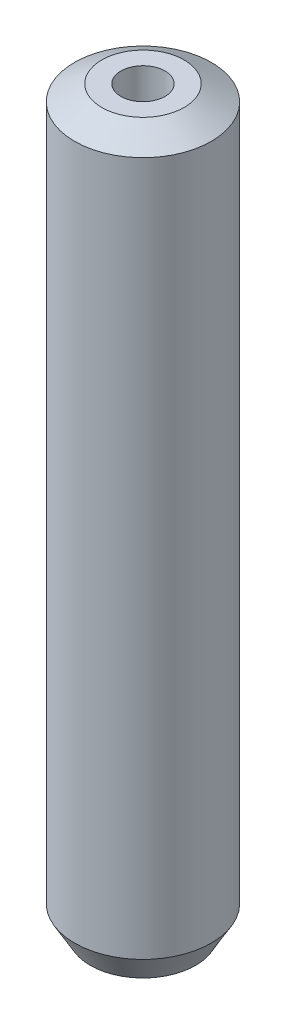
ISO-10303-21;
HEADER;
FILE_DESCRIPTION(('STEP AP214'),'2;1');
FILE_NAME('part.step','',(''),(''),'','','');
FILE_SCHEMA(('AUTOMOTIVE_DESIGN { 1 0 10303 214 1 1 1 1 }'));
ENDSEC;
DATA;
#1=APPLICATION_CONTEXT('core data for automotive mechanical design processes');
#2=APPLICATION_PROTOCOL_DEFINITION('international standard','automotive_design',2000,#1);
#3=PRODUCT_CONTEXT('',#1,'mechanical');
#4=PRODUCT('Part','Part','',(#3));
#5=PRODUCT_RELATED_PRODUCT_CATEGORY('part','',(#4));
#6=PRODUCT_DEFINITION_FORMATION('','',#4);
#7=PRODUCT_DEFINITION_CONTEXT('part definition',#1,'design');
#8=PRODUCT_DEFINITION('design','',#6,#7);
#9=PRODUCT_DEFINITION_SHAPE('','',#8);
#10=(LENGTH_UNIT() NAMED_UNIT(*) SI_UNIT(.MILLI.,.METRE.));
#11=(NAMED_UNIT(*) PLANE_ANGLE_UNIT() SI_UNIT($,.RADIAN.));
#12=(NAMED_UNIT(*) SI_UNIT($,.STERADIAN.) SOLID_ANGLE_UNIT());
#13=UNCERTAINTY_MEASURE_WITH_UNIT(LENGTH_MEASURE(1.E-05),#10,'distance_accuracy_value','');
#14=(GEOMETRIC_REPRESENTATION_CONTEXT(3) GLOBAL_UNCERTAINTY_ASSIGNED_CONTEXT((#13)) GLOBAL_UNIT_ASSIGNED_CONTEXT((#10,
#11,#12)) REPRESENTATION_CONTEXT('',''));
#15=CARTESIAN_POINT('',(0.,0.,0.));
#16=DIRECTION('',(0.,0.,1.));
#17=DIRECTION('',(1.,0.,0.));
#18=AXIS2_PLACEMENT_3D('',#15,#16,#17);
#19=CARTESIAN_POINT('',(0.,53.8896612405202,0.));
#20=DIRECTION('',(0.,-1.,0.));
#21=DIRECTION('',(0.,0.,-1.));
#22=AXIS2_PLACEMENT_3D('',#19,#20,#21);
#23=CYLINDRICAL_SURFACE('',#22,5.);
#24=CARTESIAN_POINT('',(0.,52.7414192774617,0.));
#25=DIRECTION('',(0.,1.,0.));
#26=DIRECTION('',(0.,0.,1.));
#27=AXIS2_PLACEMENT_3D('',#24,#25,#26);
#28=CIRCLE('',#27,5.);
#29=CARTESIAN_POINT('',(0.,52.7414192774617,5.));
#30=VERTEX_POINT('',#29);
#31=EDGE_CURVE('E50',#30,#30,#28,.F.);
#32=ORIENTED_EDGE('',*,*,#31,.T.);
#33=EDGE_LOOP('',(#32));
#34=FACE_BOUND('',#33,.T.);
#35=CARTESIAN_POINT('',(0.,1.98881341939999,0.));
#36=DIRECTION('',(0.,1.,0.));
#37=DIRECTION('',(0.,0.,1.));
#38=AXIS2_PLACEMENT_3D('',#35,#36,#37);
#39=CIRCLE('',#38,5.);
#40=CARTESIAN_POINT('',(0.,1.98881341939999,5.));
#41=VERTEX_POINT('',#40);
#42=EDGE_CURVE('E51',#41,#41,#39,.T.);
#43=ORIENTED_EDGE('',*,*,#42,.T.);
#44=EDGE_LOOP('',(#43));
#45=FACE_BOUND('',#44,.T.);
#46=ADVANCED_FACE('F39',(#34,#45),#23,.T.);
#47=CARTESIAN_POINT('',(0.,53.8896612405202,0.));
#48=DIRECTION('',(0.,1.,0.));
#49=DIRECTION('',(0.,0.,1.));
#50=AXIS2_PLACEMENT_3D('',#47,#48,#49);
#51=PLANE('',#50);
#52=CARTESIAN_POINT('',(0.,53.8896612405202,0.));
#53=DIRECTION('',(0.,1.,0.));
#54=DIRECTION('',(0.,0.,1.));
#55=AXIS2_PLACEMENT_3D('',#52,#53,#54);
#56=CIRCLE('',#55,3.0111865806);
#57=CARTESIAN_POINT('',(0.,53.8896612405202,3.0111865806));
#58=VERTEX_POINT('',#57);
#59=EDGE_CURVE('E54',#58,#58,#56,.T.);
#60=ORIENTED_EDGE('',*,*,#59,.T.);
#61=EDGE_LOOP('',(#60));
#62=FACE_BOUND('',#61,.T.);
#63=CARTESIAN_POINT('',(0.,53.8896612405202,0.));
#64=DIRECTION('',(0.,1.,0.));
#65=DIRECTION('',(0.,0.,1.));
#66=AXIS2_PLACEMENT_3D('',#63,#64,#65);
#67=CIRCLE('',#66,1.6135032422753);
#68=CARTESIAN_POINT('',(0.,53.8896612405202,1.6135032422753));
#69=VERTEX_POINT('',#68);
#70=EDGE_CURVE('E58',#69,#69,#67,.T.);
#71=ORIENTED_EDGE('',*,*,#70,.F.);
#72=EDGE_LOOP('',(#71));
#73=FACE_BOUND('',#72,.T.);
#74=ADVANCED_FACE('F69',(#62,#73),#51,.T.);
#75=CARTESIAN_POINT('',(0.,0.,0.));
#76=DIRECTION('',(0.,1.,0.));
#77=DIRECTION('',(0.,0.,1.));
#78=AXIS2_PLACEMENT_3D('',#75,#76,#77);
#79=PLANE('',#78);
#80=CARTESIAN_POINT('',(0.,0.,0.));
#81=DIRECTION('',(0.,1.,0.));
#82=DIRECTION('',(0.,0.,1.));
#83=AXIS2_PLACEMENT_3D('',#80,#81,#82);
#84=CIRCLE('',#83,3.85175803694147);
#85=CARTESIAN_POINT('',(0.,0.,3.85175803694147));
#86=VERTEX_POINT('',#85);
#87=EDGE_CURVE('E10',#86,#86,#84,.F.);
#88=ORIENTED_EDGE('',*,*,#87,.T.);
#89=EDGE_LOOP('',(#88));
#90=FACE_BOUND('',#89,.T.);
#91=CARTESIAN_POINT('',(0.,0.,0.));
#92=DIRECTION('',(0.,1.,0.));
#93=DIRECTION('',(0.,0.,1.));
#94=AXIS2_PLACEMENT_3D('',#91,#92,#93);
#95=CIRCLE('',#94,1.6135032422753);
#96=CARTESIAN_POINT('',(0.,0.,1.6135032422753));
#97=VERTEX_POINT('',#96);
#98=EDGE_CURVE('E63',#97,#97,#95,.T.);
#99=ORIENTED_EDGE('',*,*,#98,.T.);
#100=EDGE_LOOP('',(#99));
#101=FACE_BOUND('',#100,.T.);
#102=ADVANCED_FACE('F75',(#90,#101),#79,.F.);
#103=CARTESIAN_POINT('',(0.,53.8896612405202,0.));
#104=DIRECTION('',(0.,-1.,0.));
#105=DIRECTION('',(0.,0.,-1.));
#106=AXIS2_PLACEMENT_3D('',#103,#104,#105);
#107=CYLINDRICAL_SURFACE('',#106,1.6135032422753);
#108=ORIENTED_EDGE('',*,*,#70,.T.);
#109=EDGE_LOOP('',(#108));
#110=FACE_BOUND('',#109,.T.);
#111=ORIENTED_EDGE('',*,*,#98,.F.);
#112=EDGE_LOOP('',(#111));
#113=FACE_BOUND('',#112,.T.);
#114=ADVANCED_FACE('F70',(#110,#113),#107,.F.);
#115=CARTESIAN_POINT('',(0.,53.8896612405202,0.));
#116=DIRECTION('',(0.,-1.,0.));
#117=DIRECTION('',(0.,0.,-1.));
#118=AXIS2_PLACEMENT_3D('',#115,#116,#117);
#119=CONICAL_SURFACE('',#118,3.0111865806,1.04719755119659);
#120=ORIENTED_EDGE('',*,*,#31,.F.);
#121=EDGE_LOOP('',(#120));
#122=FACE_BOUND('',#121,.T.);
#123=ORIENTED_EDGE('',*,*,#59,.F.);
#124=EDGE_LOOP('',(#123));
#125=FACE_BOUND('',#124,.T.);
#126=ADVANCED_FACE('F81',(#122,#125),#119,.T.);
#127=CARTESIAN_POINT('',(0.,1.98881341939999,0.));
#128=DIRECTION('',(0.,1.,0.));
#129=DIRECTION('',(0.,0.,1.));
#130=AXIS2_PLACEMENT_3D('',#127,#128,#129);
#131=CONICAL_SURFACE('',#130,5.,0.523598775598301);
#132=ORIENTED_EDGE('',*,*,#87,.F.);
#133=EDGE_LOOP('',(#132));
#134=FACE_BOUND('',#133,.T.);
#135=ORIENTED_EDGE('',*,*,#42,.F.);
#136=EDGE_LOOP('',(#135));
#137=FACE_BOUND('',#136,.T.);
#138=ADVANCED_FACE('F45',(#134,#137),#131,.T.);
#139=CLOSED_SHELL('',(#46,#74,#102,#114,#126,#138));
#140=MANIFOLD_SOLID_BREP('B2',#139);
#141=ADVANCED_BREP_SHAPE_REPRESENTATION('',(#18,#140),#14);
#142=SHAPE_DEFINITION_REPRESENTATION(#9,#141);
ENDSEC;
END-ISO-10303-21;
